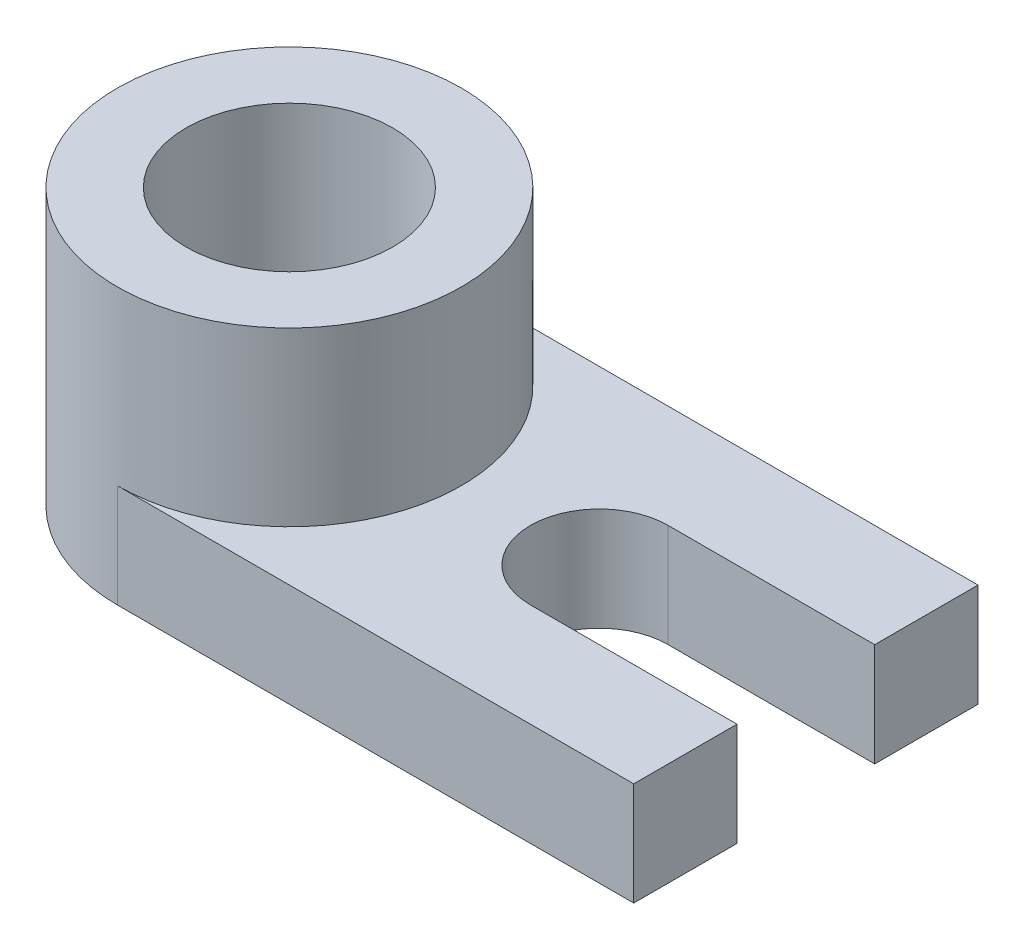
ISO-10303-21;
HEADER;
FILE_DESCRIPTION(('STEP AP214'),'2;1');
FILE_NAME('part.step','',(''),(''),'','','');
FILE_SCHEMA(('AUTOMOTIVE_DESIGN { 1 0 10303 214 1 1 1 1 }'));
ENDSEC;
DATA;
#1=APPLICATION_CONTEXT('core data for automotive mechanical design processes');
#2=APPLICATION_PROTOCOL_DEFINITION('international standard','automotive_design',2000,#1);
#3=PRODUCT_CONTEXT('',#1,'mechanical');
#4=PRODUCT('Part','Part','',(#3));
#5=PRODUCT_RELATED_PRODUCT_CATEGORY('part','',(#4));
#6=PRODUCT_DEFINITION_FORMATION('','',#4);
#7=PRODUCT_DEFINITION_CONTEXT('part definition',#1,'design');
#8=PRODUCT_DEFINITION('design','',#6,#7);
#9=PRODUCT_DEFINITION_SHAPE('','',#8);
#10=(LENGTH_UNIT() NAMED_UNIT(*) SI_UNIT(.MILLI.,.METRE.));
#11=(NAMED_UNIT(*) PLANE_ANGLE_UNIT() SI_UNIT($,.RADIAN.));
#12=(NAMED_UNIT(*) SI_UNIT($,.STERADIAN.) SOLID_ANGLE_UNIT());
#13=UNCERTAINTY_MEASURE_WITH_UNIT(LENGTH_MEASURE(1.E-05),#10,'distance_accuracy_value','');
#14=(GEOMETRIC_REPRESENTATION_CONTEXT(3) GLOBAL_UNCERTAINTY_ASSIGNED_CONTEXT((#13)) GLOBAL_UNIT_ASSIGNED_CONTEXT((#10,
#11,#12)) REPRESENTATION_CONTEXT('',''));
#15=CARTESIAN_POINT('',(0.,0.,0.));
#16=DIRECTION('',(0.,0.,1.));
#17=DIRECTION('',(1.,0.,0.));
#18=AXIS2_PLACEMENT_3D('',#15,#16,#17);
#19=CARTESIAN_POINT('',(75.,15.,0.));
#20=DIRECTION('',(-1.,0.,0.));
#21=DIRECTION('',(0.,0.,1.));
#22=AXIS2_PLACEMENT_3D('',#19,#20,#21);
#23=PLANE('',#22);
#24=DIRECTION('',(0.,0.,-1.));
#25=VECTOR('',#24,1.);
#26=CARTESIAN_POINT('',(75.,15.,0.));
#27=LINE('',#26,#25);
#28=CARTESIAN_POINT('',(75.,15.,-35.));
#29=VERTEX_POINT('',#28);
#30=CARTESIAN_POINT('',(75.,15.,-50.));
#31=VERTEX_POINT('',#30);
#32=EDGE_CURVE('E140',#29,#31,#27,.T.);
#33=ORIENTED_EDGE('',*,*,#32,.F.);
#34=DIRECTION('',(0.,1.,0.));
#35=VECTOR('',#34,1.);
#36=CARTESIAN_POINT('',(75.,15.,-35.));
#37=LINE('',#36,#35);
#38=CARTESIAN_POINT('',(75.,0.,-35.));
#39=VERTEX_POINT('',#38);
#40=EDGE_CURVE('E113',#39,#29,#37,.T.);
#41=ORIENTED_EDGE('',*,*,#40,.F.);
#42=DIRECTION('',(0.,0.,-1.));
#43=VECTOR('',#42,1.);
#44=CARTESIAN_POINT('',(75.,0.,0.));
#45=LINE('',#44,#43);
#46=CARTESIAN_POINT('',(75.,0.,-50.));
#47=VERTEX_POINT('',#46);
#48=EDGE_CURVE('E112',#39,#47,#45,.T.);
#49=ORIENTED_EDGE('',*,*,#48,.T.);
#50=DIRECTION('',(0.,-1.,0.));
#51=VECTOR('',#50,1.);
#52=CARTESIAN_POINT('',(75.,15.,-50.));
#53=LINE('',#52,#51);
#54=EDGE_CURVE('E156',#31,#47,#53,.T.);
#55=ORIENTED_EDGE('',*,*,#54,.F.);
#56=EDGE_LOOP('',(#33,#41,#49,#55));
#57=FACE_BOUND('',#56,.T.);
#58=ADVANCED_FACE('F33',(#57),#23,.F.);
#59=CARTESIAN_POINT('',(45.,0.,-25.));
#60=DIRECTION('',(0.,1.,0.));
#61=DIRECTION('',(0.,0.,1.));
#62=AXIS2_PLACEMENT_3D('',#59,#60,#61);
#63=CYLINDRICAL_SURFACE('',#62,10.);
#64=DIRECTION('',(0.,1.,0.));
#65=VECTOR('',#64,1.);
#66=CARTESIAN_POINT('',(45.,0.,-35.));
#67=LINE('',#66,#65);
#68=CARTESIAN_POINT('',(45.,0.,-35.));
#69=VERTEX_POINT('',#68);
#70=CARTESIAN_POINT('',(45.,15.,-35.));
#71=VERTEX_POINT('',#70);
#72=EDGE_CURVE('E95',#69,#71,#67,.T.);
#73=ORIENTED_EDGE('',*,*,#72,.T.);
#74=CARTESIAN_POINT('',(45.,15.,-25.));
#75=DIRECTION('',(0.,1.,0.));
#76=DIRECTION('',(0.,0.,1.));
#77=AXIS2_PLACEMENT_3D('',#74,#75,#76);
#78=CIRCLE('',#77,10.);
#79=CARTESIAN_POINT('',(45.,15.,-15.));
#80=VERTEX_POINT('',#79);
#81=EDGE_CURVE('E118',#71,#80,#78,.T.);
#82=ORIENTED_EDGE('',*,*,#81,.T.);
#83=DIRECTION('',(0.,1.,0.));
#84=VECTOR('',#83,1.);
#85=CARTESIAN_POINT('',(45.,0.,-15.));
#86=LINE('',#85,#84);
#87=CARTESIAN_POINT('',(45.,0.,-15.));
#88=VERTEX_POINT('',#87);
#89=EDGE_CURVE('E116',#88,#80,#86,.T.);
#90=ORIENTED_EDGE('',*,*,#89,.F.);
#91=CARTESIAN_POINT('',(45.,0.,-25.));
#92=DIRECTION('',(0.,1.,0.));
#93=DIRECTION('',(0.,0.,1.));
#94=AXIS2_PLACEMENT_3D('',#91,#92,#93);
#95=CIRCLE('',#94,10.);
#96=EDGE_CURVE('E110',#69,#88,#95,.T.);
#97=ORIENTED_EDGE('',*,*,#96,.F.);
#98=EDGE_LOOP('',(#73,#82,#90,#97));
#99=FACE_BOUND('',#98,.T.);
#100=ADVANCED_FACE('F115',(#99),#63,.F.);
#101=CARTESIAN_POINT('',(0.,15.,0.));
#102=DIRECTION('',(0.,0.,-1.));
#103=DIRECTION('',(-1.,0.,0.));
#104=AXIS2_PLACEMENT_3D('',#101,#102,#103);
#105=PLANE('',#104);
#106=DIRECTION('',(1.,0.,0.));
#107=VECTOR('',#106,1.);
#108=CARTESIAN_POINT('',(0.,0.,0.));
#109=LINE('',#108,#107);
#110=CARTESIAN_POINT('',(0.,0.,0.));
#111=VERTEX_POINT('',#110);
#112=CARTESIAN_POINT('',(75.,0.,0.));
#113=VERTEX_POINT('',#112);
#114=EDGE_CURVE('E137',#111,#113,#109,.T.);
#115=ORIENTED_EDGE('',*,*,#114,.T.);
#116=DIRECTION('',(0.,-1.,0.));
#117=VECTOR('',#116,1.);
#118=CARTESIAN_POINT('',(75.,15.,0.));
#119=LINE('',#118,#117);
#120=CARTESIAN_POINT('',(75.,15.,0.));
#121=VERTEX_POINT('',#120);
#122=EDGE_CURVE('E41',#121,#113,#119,.T.);
#123=ORIENTED_EDGE('',*,*,#122,.F.);
#124=DIRECTION('',(1.,0.,0.));
#125=VECTOR('',#124,1.);
#126=CARTESIAN_POINT('',(0.,15.,0.));
#127=LINE('',#126,#125);
#128=CARTESIAN_POINT('',(0.,15.,0.));
#129=VERTEX_POINT('',#128);
#130=EDGE_CURVE('E138',#129,#121,#127,.T.);
#131=ORIENTED_EDGE('',*,*,#130,.F.);
#132=DIRECTION('',(0.,-1.,0.));
#133=VECTOR('',#132,1.);
#134=CARTESIAN_POINT('',(0.,15.,0.));
#135=LINE('',#134,#133);
#136=EDGE_CURVE('E11',#129,#111,#135,.T.);
#137=ORIENTED_EDGE('',*,*,#136,.T.);
#138=EDGE_LOOP('',(#115,#123,#131,#137));
#139=FACE_BOUND('',#138,.T.);
#140=ADVANCED_FACE('F35',(#139),#105,.F.);
#141=CARTESIAN_POINT('',(75.,0.,-15.));
#142=VERTEX_POINT('',#141);
#143=EDGE_CURVE('E150',#113,#142,#45,.T.);
#144=ORIENTED_EDGE('',*,*,#143,.T.);
#145=DIRECTION('',(0.,-1.,0.));
#146=VECTOR('',#145,1.);
#147=CARTESIAN_POINT('',(75.,15.,-15.));
#148=LINE('',#147,#146);
#149=CARTESIAN_POINT('',(75.,15.,-15.));
#150=VERTEX_POINT('',#149);
#151=EDGE_CURVE('E174',#150,#142,#148,.T.);
#152=ORIENTED_EDGE('',*,*,#151,.F.);
#153=EDGE_CURVE('E142',#121,#150,#27,.T.);
#154=ORIENTED_EDGE('',*,*,#153,.F.);
#155=ORIENTED_EDGE('',*,*,#122,.T.);
#156=EDGE_LOOP('',(#144,#152,#154,#155));
#157=FACE_BOUND('',#156,.T.);
#158=ADVANCED_FACE('F163',(#157),#23,.F.);
#159=CARTESIAN_POINT('',(0.,15.,-50.));
#160=DIRECTION('',(0.,0.,1.));
#161=DIRECTION('',(1.,0.,0.));
#162=AXIS2_PLACEMENT_3D('',#159,#160,#161);
#163=PLANE('',#162);
#164=DIRECTION('',(-1.,0.,0.));
#165=VECTOR('',#164,1.);
#166=CARTESIAN_POINT('',(0.,0.,-50.));
#167=LINE('',#166,#165);
#168=CARTESIAN_POINT('',(0.,0.,-50.));
#169=VERTEX_POINT('',#168);
#170=EDGE_CURVE('E141',#47,#169,#167,.T.);
#171=ORIENTED_EDGE('',*,*,#170,.T.);
#172=DIRECTION('',(0.,-1.,0.));
#173=VECTOR('',#172,1.);
#174=CARTESIAN_POINT('',(0.,15.,-50.));
#175=LINE('',#174,#173);
#176=CARTESIAN_POINT('',(0.,15.,-50.));
#177=VERTEX_POINT('',#176);
#178=EDGE_CURVE('E148',#177,#169,#175,.T.);
#179=ORIENTED_EDGE('',*,*,#178,.F.);
#180=DIRECTION('',(-1.,0.,0.));
#181=VECTOR('',#180,1.);
#182=CARTESIAN_POINT('',(0.,15.,-50.));
#183=LINE('',#182,#181);
#184=EDGE_CURVE('E145',#31,#177,#183,.T.);
#185=ORIENTED_EDGE('',*,*,#184,.F.);
#186=ORIENTED_EDGE('',*,*,#54,.T.);
#187=EDGE_LOOP('',(#171,#179,#185,#186));
#188=FACE_BOUND('',#187,.T.);
#189=ADVANCED_FACE('F184',(#188),#163,.F.);
#190=CARTESIAN_POINT('',(0.,15.,0.));
#191=DIRECTION('',(0.,-1.,0.));
#192=DIRECTION('',(0.,0.,-1.));
#193=AXIS2_PLACEMENT_3D('',#190,#191,#192);
#194=PLANE('',#193);
#195=ORIENTED_EDGE('',*,*,#81,.F.);
#196=DIRECTION('',(1.,0.,0.));
#197=VECTOR('',#196,1.);
#198=CARTESIAN_POINT('',(-25.001,15.,-35.));
#199=LINE('',#198,#197);
#200=EDGE_CURVE('E48',#71,#29,#199,.T.);
#201=ORIENTED_EDGE('',*,*,#200,.T.);
#202=ORIENTED_EDGE('',*,*,#32,.T.);
#203=ORIENTED_EDGE('',*,*,#184,.T.);
#204=CARTESIAN_POINT('',(0.,15.,-25.));
#205=DIRECTION('',(0.,-1.,0.));
#206=DIRECTION('',(0.,0.,-1.));
#207=AXIS2_PLACEMENT_3D('',#204,#205,#206);
#208=CIRCLE('',#207,25.);
#209=EDGE_CURVE('E132',#177,#129,#208,.T.);
#210=ORIENTED_EDGE('',*,*,#209,.T.);
#211=ORIENTED_EDGE('',*,*,#130,.T.);
#212=ORIENTED_EDGE('',*,*,#153,.T.);
#213=DIRECTION('',(1.,0.,0.));
#214=VECTOR('',#213,1.);
#215=CARTESIAN_POINT('',(-25.001,15.,-15.));
#216=LINE('',#215,#214);
#217=EDGE_CURVE('E168',#80,#150,#216,.T.);
#218=ORIENTED_EDGE('',*,*,#217,.F.);
#219=EDGE_LOOP('',(#195,#201,#202,#203,#210,#211,#212,#218));
#220=FACE_BOUND('',#219,.T.);
#221=ADVANCED_FACE('F179',(#220),#194,.F.);
#222=CARTESIAN_POINT('',(0.,0.,0.));
#223=DIRECTION('',(0.,-1.,0.));
#224=DIRECTION('',(0.,0.,-1.));
#225=AXIS2_PLACEMENT_3D('',#222,#223,#224);
#226=PLANE('',#225);
#227=DIRECTION('',(1.,0.,0.));
#228=VECTOR('',#227,1.);
#229=CARTESIAN_POINT('',(-25.001,0.,-35.));
#230=LINE('',#229,#228);
#231=EDGE_CURVE('E98',#69,#39,#230,.T.);
#232=ORIENTED_EDGE('',*,*,#231,.F.);
#233=ORIENTED_EDGE('',*,*,#96,.T.);
#234=DIRECTION('',(1.,0.,0.));
#235=VECTOR('',#234,1.);
#236=CARTESIAN_POINT('',(-25.001,0.,-15.));
#237=LINE('',#236,#235);
#238=EDGE_CURVE('E56',#88,#142,#237,.T.);
#239=ORIENTED_EDGE('',*,*,#238,.T.);
#240=ORIENTED_EDGE('',*,*,#143,.F.);
#241=ORIENTED_EDGE('',*,*,#114,.F.);
#242=CARTESIAN_POINT('',(0.,0.,-25.));
#243=DIRECTION('',(0.,-1.,0.));
#244=DIRECTION('',(0.,0.,-1.));
#245=AXIS2_PLACEMENT_3D('',#242,#243,#244);
#246=CIRCLE('',#245,25.);
#247=EDGE_CURVE('E127',#111,#169,#246,.T.);
#248=ORIENTED_EDGE('',*,*,#247,.T.);
#249=ORIENTED_EDGE('',*,*,#170,.F.);
#250=ORIENTED_EDGE('',*,*,#48,.F.);
#251=EDGE_LOOP('',(#232,#233,#239,#240,#241,#248,#249,#250));
#252=FACE_BOUND('',#251,.T.);
#253=CARTESIAN_POINT('',(0.,0.,-25.));
#254=DIRECTION('',(0.,1.,0.));
#255=DIRECTION('',(0.,0.,1.));
#256=AXIS2_PLACEMENT_3D('',#253,#254,#255);
#257=CIRCLE('',#256,15.);
#258=CARTESIAN_POINT('',(0.,0.,-10.));
#259=VERTEX_POINT('',#258);
#260=EDGE_CURVE('E121',#259,#259,#257,.T.);
#261=ORIENTED_EDGE('',*,*,#260,.T.);
#262=EDGE_LOOP('',(#261));
#263=FACE_BOUND('',#262,.T.);
#264=ADVANCED_FACE('F108',(#252,#263),#226,.T.);
#265=CARTESIAN_POINT('',(0.,40.,-25.));
#266=DIRECTION('',(0.,-1.,0.));
#267=DIRECTION('',(0.,0.,-1.));
#268=AXIS2_PLACEMENT_3D('',#265,#266,#267);
#269=CYLINDRICAL_SURFACE('',#268,25.);
#270=CARTESIAN_POINT('',(0.,40.,-25.));
#271=DIRECTION('',(0.,-1.,0.));
#272=DIRECTION('',(0.,0.,-1.));
#273=AXIS2_PLACEMENT_3D('',#270,#271,#272);
#274=CIRCLE('',#273,25.);
#275=CARTESIAN_POINT('',(0.,40.,-50.));
#276=VERTEX_POINT('',#275);
#277=EDGE_CURVE('E129',#276,#276,#274,.T.);
#278=ORIENTED_EDGE('',*,*,#277,.T.);
#279=EDGE_LOOP('',(#278));
#280=FACE_BOUND('',#279,.T.);
#281=ORIENTED_EDGE('',*,*,#136,.F.);
#282=ORIENTED_EDGE('',*,*,#209,.F.);
#283=ORIENTED_EDGE('',*,*,#178,.T.);
#284=ORIENTED_EDGE('',*,*,#247,.F.);
#285=EDGE_LOOP('',(#281,#282,#283,#284));
#286=FACE_BOUND('',#285,.T.);
#287=ADVANCED_FACE('F186',(#280,#286),#269,.T.);
#288=CARTESIAN_POINT('',(0.,40.,-25.));
#289=DIRECTION('',(0.,-1.,0.));
#290=DIRECTION('',(0.,0.,-1.));
#291=AXIS2_PLACEMENT_3D('',#288,#289,#290);
#292=PLANE('',#291);
#293=CARTESIAN_POINT('',(0.,40.,-25.));
#294=DIRECTION('',(0.,1.,0.));
#295=DIRECTION('',(0.,0.,1.));
#296=AXIS2_PLACEMENT_3D('',#293,#294,#295);
#297=CIRCLE('',#296,15.);
#298=CARTESIAN_POINT('',(0.,40.,-10.));
#299=VERTEX_POINT('',#298);
#300=EDGE_CURVE('E117',#299,#299,#297,.T.);
#301=ORIENTED_EDGE('',*,*,#300,.F.);
#302=EDGE_LOOP('',(#301));
#303=FACE_BOUND('',#302,.T.);
#304=ORIENTED_EDGE('',*,*,#277,.F.);
#305=EDGE_LOOP('',(#304));
#306=FACE_BOUND('',#305,.T.);
#307=ADVANCED_FACE('F188',(#303,#306),#292,.F.);
#308=CARTESIAN_POINT('',(0.,0.,-25.));
#309=DIRECTION('',(0.,1.,0.));
#310=DIRECTION('',(0.,0.,1.));
#311=AXIS2_PLACEMENT_3D('',#308,#309,#310);
#312=CYLINDRICAL_SURFACE('',#311,15.);
#313=ORIENTED_EDGE('',*,*,#260,.F.);
#314=EDGE_LOOP('',(#313));
#315=FACE_BOUND('',#314,.T.);
#316=ORIENTED_EDGE('',*,*,#300,.T.);
#317=EDGE_LOOP('',(#316));
#318=FACE_BOUND('',#317,.T.);
#319=ADVANCED_FACE('F195',(#315,#318),#312,.F.);
#320=CARTESIAN_POINT('',(-25.001,15.,-15.));
#321=DIRECTION('',(0.,0.,1.));
#322=DIRECTION('',(0.,-1.,0.));
#323=AXIS2_PLACEMENT_3D('',#320,#321,#322);
#324=PLANE('',#323);
#325=ORIENTED_EDGE('',*,*,#89,.T.);
#326=ORIENTED_EDGE('',*,*,#217,.T.);
#327=ORIENTED_EDGE('',*,*,#151,.T.);
#328=ORIENTED_EDGE('',*,*,#238,.F.);
#329=EDGE_LOOP('',(#325,#326,#327,#328));
#330=FACE_BOUND('',#329,.T.);
#331=ADVANCED_FACE('F247',(#330),#324,.F.);
#332=CARTESIAN_POINT('',(-25.001,15.,-35.));
#333=DIRECTION('',(0.,0.,-1.));
#334=DIRECTION('',(-1.,0.,0.));
#335=AXIS2_PLACEMENT_3D('',#332,#333,#334);
#336=PLANE('',#335);
#337=ORIENTED_EDGE('',*,*,#231,.T.);
#338=ORIENTED_EDGE('',*,*,#40,.T.);
#339=ORIENTED_EDGE('',*,*,#200,.F.);
#340=ORIENTED_EDGE('',*,*,#72,.F.);
#341=EDGE_LOOP('',(#337,#338,#339,#340));
#342=FACE_BOUND('',#341,.T.);
#343=ADVANCED_FACE('F97',(#342),#336,.F.);
#344=CLOSED_SHELL('',(#58,#100,#140,#158,#189,#221,#264,#287,#307,#319,#331,#343));
#345=MANIFOLD_SOLID_BREP('B2',#344);
#346=ADVANCED_BREP_SHAPE_REPRESENTATION('',(#18,#345),#14);
#347=SHAPE_DEFINITION_REPRESENTATION(#9,#346);
ENDSEC;
END-ISO-10303-21;
